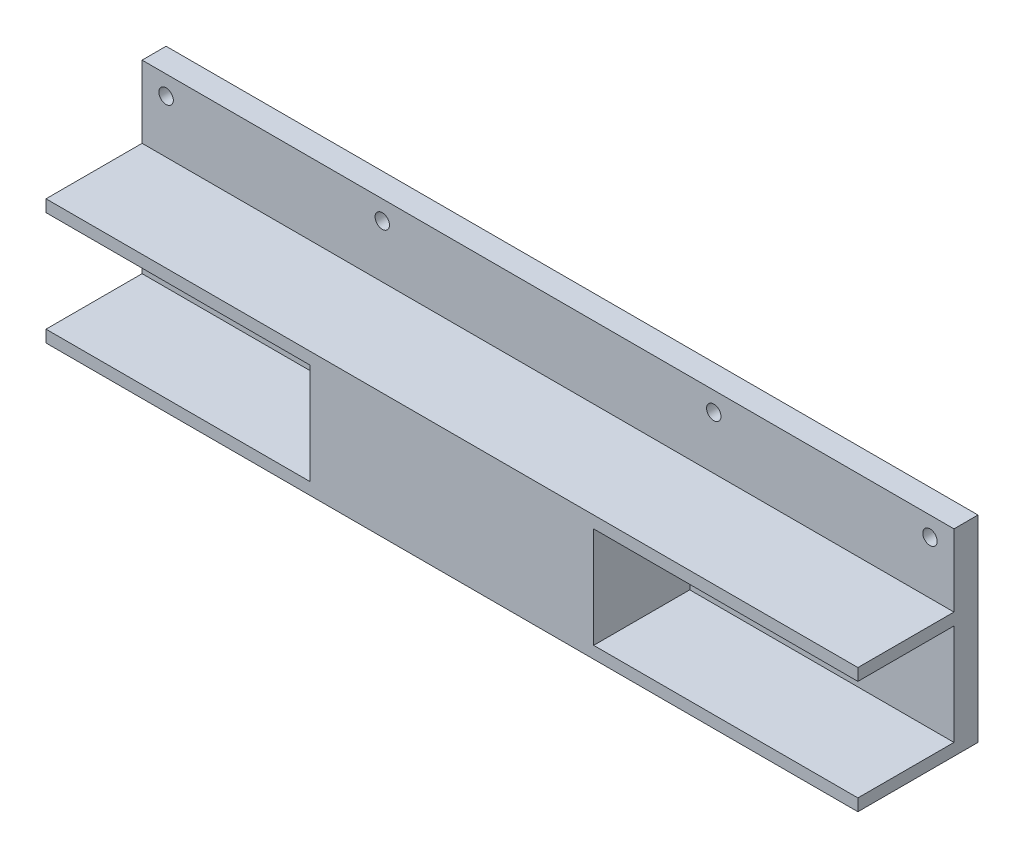
ISO-10303-21;
HEADER;
FILE_DESCRIPTION(('STEP AP214'),'2;1');
FILE_NAME('part.step','',(''),(''),'','','');
FILE_SCHEMA(('AUTOMOTIVE_DESIGN { 1 0 10303 214 1 1 1 1 }'));
ENDSEC;
DATA;
#1=APPLICATION_CONTEXT('core data for automotive mechanical design processes');
#2=APPLICATION_PROTOCOL_DEFINITION('international standard','automotive_design',2000,#1);
#3=PRODUCT_CONTEXT('',#1,'mechanical');
#4=PRODUCT('Part','Part','',(#3));
#5=PRODUCT_RELATED_PRODUCT_CATEGORY('part','',(#4));
#6=PRODUCT_DEFINITION_FORMATION('','',#4);
#7=PRODUCT_DEFINITION_CONTEXT('part definition',#1,'design');
#8=PRODUCT_DEFINITION('design','',#6,#7);
#9=PRODUCT_DEFINITION_SHAPE('','',#8);
#10=(LENGTH_UNIT() NAMED_UNIT(*) SI_UNIT(.MILLI.,.METRE.));
#11=(NAMED_UNIT(*) PLANE_ANGLE_UNIT() SI_UNIT($,.RADIAN.));
#12=(NAMED_UNIT(*) SI_UNIT($,.STERADIAN.) SOLID_ANGLE_UNIT());
#13=UNCERTAINTY_MEASURE_WITH_UNIT(LENGTH_MEASURE(1.E-05),#10,'distance_accuracy_value','');
#14=(GEOMETRIC_REPRESENTATION_CONTEXT(3) GLOBAL_UNCERTAINTY_ASSIGNED_CONTEXT((#13)) GLOBAL_UNIT_ASSIGNED_CONTEXT((#10,
#11,#12)) REPRESENTATION_CONTEXT('',''));
#15=CARTESIAN_POINT('',(0.,0.,0.));
#16=DIRECTION('',(0.,0.,1.));
#17=DIRECTION('',(1.,0.,0.));
#18=AXIS2_PLACEMENT_3D('',#15,#16,#17);
#19=CARTESIAN_POINT('',(0.,0.,5.));
#20=DIRECTION('',(0.,0.,-1.));
#21=DIRECTION('',(-1.,0.,0.));
#22=AXIS2_PLACEMENT_3D('',#19,#20,#21);
#23=PLANE('',#22);
#24=CARTESIAN_POINT('',(-79.5,16.5,5.));
#25=DIRECTION('',(0.,0.,1.));
#26=DIRECTION('',(1.,0.,0.));
#27=AXIS2_PLACEMENT_3D('',#24,#25,#26);
#28=CIRCLE('',#27,1.5);
#29=CARTESIAN_POINT('',(-78.,16.5,5.));
#30=VERTEX_POINT('',#29);
#31=EDGE_CURVE('E210',#30,#30,#28,.T.);
#32=ORIENTED_EDGE('',*,*,#31,.F.);
#33=EDGE_LOOP('',(#32));
#34=FACE_BOUND('',#33,.T.);
#35=CARTESIAN_POINT('',(-34.5,16.5,5.));
#36=DIRECTION('',(0.,0.,1.));
#37=DIRECTION('',(1.,0.,0.));
#38=AXIS2_PLACEMENT_3D('',#35,#36,#37);
#39=CIRCLE('',#38,1.5);
#40=CARTESIAN_POINT('',(-33.,16.5,5.));
#41=VERTEX_POINT('',#40);
#42=EDGE_CURVE('E227',#41,#41,#39,.T.);
#43=ORIENTED_EDGE('',*,*,#42,.F.);
#44=EDGE_LOOP('',(#43));
#45=FACE_BOUND('',#44,.T.);
#46=CARTESIAN_POINT('',(34.5,16.5,5.));
#47=DIRECTION('',(0.,0.,1.));
#48=DIRECTION('',(1.,0.,0.));
#49=AXIS2_PLACEMENT_3D('',#46,#47,#48);
#50=CIRCLE('',#49,1.5);
#51=CARTESIAN_POINT('',(36.,16.5,5.));
#52=VERTEX_POINT('',#51);
#53=EDGE_CURVE('E221',#52,#52,#50,.T.);
#54=ORIENTED_EDGE('',*,*,#53,.F.);
#55=EDGE_LOOP('',(#54));
#56=FACE_BOUND('',#55,.T.);
#57=CARTESIAN_POINT('',(79.5,16.5,5.));
#58=DIRECTION('',(0.,0.,1.));
#59=DIRECTION('',(1.,0.,0.));
#60=AXIS2_PLACEMENT_3D('',#57,#58,#59);
#61=CIRCLE('',#60,1.5);
#62=CARTESIAN_POINT('',(81.,16.5,5.));
#63=VERTEX_POINT('',#62);
#64=EDGE_CURVE('E215',#63,#63,#61,.T.);
#65=ORIENTED_EDGE('',*,*,#64,.F.);
#66=EDGE_LOOP('',(#65));
#67=FACE_BOUND('',#66,.T.);
#68=DIRECTION('',(-1.,0.,0.));
#69=VECTOR('',#68,1.);
#70=CARTESIAN_POINT('',(-84.5,5.49999999999996,5.));
#71=LINE('',#70,#69);
#72=CARTESIAN_POINT('',(84.5,5.49999999999997,5.));
#73=VERTEX_POINT('',#72);
#74=CARTESIAN_POINT('',(-84.5,5.49999999999996,5.));
#75=VERTEX_POINT('',#74);
#76=EDGE_CURVE('E186',#73,#75,#71,.T.);
#77=ORIENTED_EDGE('',*,*,#76,.F.);
#78=DIRECTION('',(0.,1.,0.));
#79=VECTOR('',#78,1.);
#80=CARTESIAN_POINT('',(84.5,-20.5,5.));
#81=LINE('',#80,#79);
#82=CARTESIAN_POINT('',(84.5,20.5,5.));
#83=VERTEX_POINT('',#82);
#84=EDGE_CURVE('E235',#73,#83,#81,.T.);
#85=ORIENTED_EDGE('',*,*,#84,.T.);
#86=DIRECTION('',(-1.,0.,0.));
#87=VECTOR('',#86,1.);
#88=CARTESIAN_POINT('',(-84.5,20.5,5.));
#89=LINE('',#88,#87);
#90=CARTESIAN_POINT('',(-84.5,20.5,5.));
#91=VERTEX_POINT('',#90);
#92=EDGE_CURVE('E237',#83,#91,#89,.T.);
#93=ORIENTED_EDGE('',*,*,#92,.T.);
#94=DIRECTION('',(0.,-1.,0.));
#95=VECTOR('',#94,1.);
#96=CARTESIAN_POINT('',(-84.5,-20.5,5.));
#97=LINE('',#96,#95);
#98=EDGE_CURVE('E240',#91,#75,#97,.T.);
#99=ORIENTED_EDGE('',*,*,#98,.T.);
#100=EDGE_LOOP('',(#77,#85,#93,#99));
#101=FACE_BOUND('',#100,.T.);
#102=ADVANCED_FACE('F33',(#34,#45,#56,#67,#101),#23,.F.);
#103=CARTESIAN_POINT('',(84.5,-20.5,5.));
#104=DIRECTION('',(-1.,0.,0.));
#105=DIRECTION('',(0.,0.,1.));
#106=AXIS2_PLACEMENT_3D('',#103,#104,#105);
#107=PLANE('',#106);
#108=DIRECTION('',(0.,1.,0.));
#109=VECTOR('',#108,1.);
#110=CARTESIAN_POINT('',(84.5,-20.5,25.));
#111=LINE('',#110,#109);
#112=CARTESIAN_POINT('',(84.5,2.99999999999998,25.));
#113=VERTEX_POINT('',#112);
#114=CARTESIAN_POINT('',(84.5,5.49999999999998,25.));
#115=VERTEX_POINT('',#114);
#116=EDGE_CURVE('E198',#113,#115,#111,.T.);
#117=ORIENTED_EDGE('',*,*,#116,.F.);
#118=DIRECTION('',(0.,0.,1.));
#119=VECTOR('',#118,1.);
#120=CARTESIAN_POINT('',(84.5,2.99999999999998,25.));
#121=LINE('',#120,#119);
#122=CARTESIAN_POINT('',(84.5,2.99999999999998,5.));
#123=VERTEX_POINT('',#122);
#124=EDGE_CURVE('E152',#123,#113,#121,.T.);
#125=ORIENTED_EDGE('',*,*,#124,.F.);
#126=DIRECTION('',(0.,1.,0.));
#127=VECTOR('',#126,1.);
#128=CARTESIAN_POINT('',(84.5,2.99999999999998,5.));
#129=LINE('',#128,#127);
#130=CARTESIAN_POINT('',(84.5,-18.,4.99999999999999));
#131=VERTEX_POINT('',#130);
#132=EDGE_CURVE('E278',#131,#123,#129,.T.);
#133=ORIENTED_EDGE('',*,*,#132,.F.);
#134=DIRECTION('',(0.,0.,-1.));
#135=VECTOR('',#134,1.);
#136=CARTESIAN_POINT('',(84.5,-18.,25.));
#137=LINE('',#136,#135);
#138=CARTESIAN_POINT('',(84.5,-18.,25.));
#139=VERTEX_POINT('',#138);
#140=EDGE_CURVE('E275',#139,#131,#137,.T.);
#141=ORIENTED_EDGE('',*,*,#140,.F.);
#142=CARTESIAN_POINT('',(84.5,-20.5,25.));
#143=VERTEX_POINT('',#142);
#144=EDGE_CURVE('E158',#143,#139,#111,.T.);
#145=ORIENTED_EDGE('',*,*,#144,.F.);
#146=DIRECTION('',(0.,0.,-1.));
#147=VECTOR('',#146,1.);
#148=CARTESIAN_POINT('',(84.5,-20.5,5.));
#149=LINE('',#148,#147);
#150=CARTESIAN_POINT('',(84.5,-20.5,0.));
#151=VERTEX_POINT('',#150);
#152=EDGE_CURVE('E242',#143,#151,#149,.T.);
#153=ORIENTED_EDGE('',*,*,#152,.T.);
#154=DIRECTION('',(0.,1.,0.));
#155=VECTOR('',#154,1.);
#156=CARTESIAN_POINT('',(84.5,-20.5,0.));
#157=LINE('',#156,#155);
#158=CARTESIAN_POINT('',(84.5,20.5,0.));
#159=VERTEX_POINT('',#158);
#160=EDGE_CURVE('E214',#151,#159,#157,.T.);
#161=ORIENTED_EDGE('',*,*,#160,.T.);
#162=DIRECTION('',(0.,0.,-1.));
#163=VECTOR('',#162,1.);
#164=CARTESIAN_POINT('',(84.5,20.5,5.));
#165=LINE('',#164,#163);
#166=EDGE_CURVE('E11',#83,#159,#165,.T.);
#167=ORIENTED_EDGE('',*,*,#166,.F.);
#168=ORIENTED_EDGE('',*,*,#84,.F.);
#169=DIRECTION('',(0.,0.,-1.));
#170=VECTOR('',#169,1.);
#171=CARTESIAN_POINT('',(84.5,5.49999999999998,25.));
#172=LINE('',#171,#170);
#173=EDGE_CURVE('E207',#115,#73,#172,.T.);
#174=ORIENTED_EDGE('',*,*,#173,.F.);
#175=EDGE_LOOP('',(#117,#125,#133,#141,#145,#153,#161,#167,#168,#174));
#176=FACE_BOUND('',#175,.T.);
#177=ADVANCED_FACE('F35',(#176),#107,.F.);
#178=CARTESIAN_POINT('',(-84.5,20.5,5.));
#179=DIRECTION('',(0.,-1.,0.));
#180=DIRECTION('',(1.,0.,0.));
#181=AXIS2_PLACEMENT_3D('',#178,#179,#180);
#182=PLANE('',#181);
#183=DIRECTION('',(-1.,0.,0.));
#184=VECTOR('',#183,1.);
#185=CARTESIAN_POINT('',(-84.5,20.5,0.));
#186=LINE('',#185,#184);
#187=CARTESIAN_POINT('',(-84.5,20.5,0.));
#188=VERTEX_POINT('',#187);
#189=EDGE_CURVE('E245',#159,#188,#186,.T.);
#190=ORIENTED_EDGE('',*,*,#189,.T.);
#191=DIRECTION('',(0.,0.,-1.));
#192=VECTOR('',#191,1.);
#193=CARTESIAN_POINT('',(-84.5,20.5,5.));
#194=LINE('',#193,#192);
#195=EDGE_CURVE('E41',#91,#188,#194,.T.);
#196=ORIENTED_EDGE('',*,*,#195,.F.);
#197=ORIENTED_EDGE('',*,*,#92,.F.);
#198=ORIENTED_EDGE('',*,*,#166,.T.);
#199=EDGE_LOOP('',(#190,#196,#197,#198));
#200=FACE_BOUND('',#199,.T.);
#201=ADVANCED_FACE('F322',(#200),#182,.F.);
#202=CARTESIAN_POINT('',(-84.5,-20.5,5.));
#203=DIRECTION('',(1.,0.,0.));
#204=DIRECTION('',(0.,0.,-1.));
#205=AXIS2_PLACEMENT_3D('',#202,#203,#204);
#206=PLANE('',#205);
#207=DIRECTION('',(0.,-1.,0.));
#208=VECTOR('',#207,1.);
#209=CARTESIAN_POINT('',(-84.5,-20.5,25.));
#210=LINE('',#209,#208);
#211=CARTESIAN_POINT('',(-84.5,-18.,25.));
#212=VERTEX_POINT('',#211);
#213=CARTESIAN_POINT('',(-84.5,-20.5,25.));
#214=VERTEX_POINT('',#213);
#215=EDGE_CURVE('E196',#212,#214,#210,.T.);
#216=ORIENTED_EDGE('',*,*,#215,.F.);
#217=DIRECTION('',(0.,0.,1.));
#218=VECTOR('',#217,1.);
#219=CARTESIAN_POINT('',(-84.5,-18.,25.));
#220=LINE('',#219,#218);
#221=CARTESIAN_POINT('',(-84.5,-18.,5.));
#222=VERTEX_POINT('',#221);
#223=EDGE_CURVE('E168',#222,#212,#220,.T.);
#224=ORIENTED_EDGE('',*,*,#223,.F.);
#225=DIRECTION('',(0.,-1.,0.));
#226=VECTOR('',#225,1.);
#227=CARTESIAN_POINT('',(-84.5,-18.,5.));
#228=LINE('',#227,#226);
#229=CARTESIAN_POINT('',(-84.5,2.99999999999995,5.));
#230=VERTEX_POINT('',#229);
#231=EDGE_CURVE('E178',#230,#222,#228,.T.);
#232=ORIENTED_EDGE('',*,*,#231,.F.);
#233=DIRECTION('',(0.,0.,-1.));
#234=VECTOR('',#233,1.);
#235=CARTESIAN_POINT('',(-84.5,2.99999999999996,25.));
#236=LINE('',#235,#234);
#237=CARTESIAN_POINT('',(-84.5,2.99999999999996,25.));
#238=VERTEX_POINT('',#237);
#239=EDGE_CURVE('E175',#238,#230,#236,.T.);
#240=ORIENTED_EDGE('',*,*,#239,.F.);
#241=CARTESIAN_POINT('',(-84.5,5.49999999999996,25.));
#242=VERTEX_POINT('',#241);
#243=EDGE_CURVE('E192',#242,#238,#210,.T.);
#244=ORIENTED_EDGE('',*,*,#243,.F.);
#245=DIRECTION('',(0.,0.,-1.));
#246=VECTOR('',#245,1.);
#247=CARTESIAN_POINT('',(-84.5,5.49999999999996,25.));
#248=LINE('',#247,#246);
#249=EDGE_CURVE('E202',#242,#75,#248,.T.);
#250=ORIENTED_EDGE('',*,*,#249,.T.);
#251=ORIENTED_EDGE('',*,*,#98,.F.);
#252=ORIENTED_EDGE('',*,*,#195,.T.);
#253=DIRECTION('',(0.,-1.,0.));
#254=VECTOR('',#253,1.);
#255=CARTESIAN_POINT('',(-84.5,-20.5,0.));
#256=LINE('',#255,#254);
#257=CARTESIAN_POINT('',(-84.5,-20.5,0.));
#258=VERTEX_POINT('',#257);
#259=EDGE_CURVE('E247',#188,#258,#256,.T.);
#260=ORIENTED_EDGE('',*,*,#259,.T.);
#261=DIRECTION('',(0.,0.,-1.));
#262=VECTOR('',#261,1.);
#263=CARTESIAN_POINT('',(-84.5,-20.5,5.));
#264=LINE('',#263,#262);
#265=EDGE_CURVE('E252',#214,#258,#264,.T.);
#266=ORIENTED_EDGE('',*,*,#265,.F.);
#267=EDGE_LOOP('',(#216,#224,#232,#240,#244,#250,#251,#252,#260,#266));
#268=FACE_BOUND('',#267,.T.);
#269=ADVANCED_FACE('F260',(#268),#206,.F.);
#270=CARTESIAN_POINT('',(-84.5,-20.5,5.));
#271=DIRECTION('',(0.,1.,0.));
#272=DIRECTION('',(-1.,0.,0.));
#273=AXIS2_PLACEMENT_3D('',#270,#271,#272);
#274=PLANE('',#273);
#275=DIRECTION('',(1.,0.,0.));
#276=VECTOR('',#275,1.);
#277=CARTESIAN_POINT('',(-84.5,-20.5,0.));
#278=LINE('',#277,#276);
#279=EDGE_CURVE('E238',#258,#151,#278,.T.);
#280=ORIENTED_EDGE('',*,*,#279,.T.);
#281=ORIENTED_EDGE('',*,*,#152,.F.);
#282=DIRECTION('',(1.,0.,0.));
#283=VECTOR('',#282,1.);
#284=CARTESIAN_POINT('',(-84.5,-20.5,25.));
#285=LINE('',#284,#283);
#286=EDGE_CURVE('E195',#214,#143,#285,.T.);
#287=ORIENTED_EDGE('',*,*,#286,.F.);
#288=ORIENTED_EDGE('',*,*,#265,.T.);
#289=EDGE_LOOP('',(#280,#281,#287,#288));
#290=FACE_BOUND('',#289,.T.);
#291=ADVANCED_FACE('F269',(#290),#274,.F.);
#292=CARTESIAN_POINT('',(0.,0.,0.));
#293=DIRECTION('',(0.,0.,-1.));
#294=DIRECTION('',(-1.,0.,0.));
#295=AXIS2_PLACEMENT_3D('',#292,#293,#294);
#296=PLANE('',#295);
#297=CARTESIAN_POINT('',(79.5,16.5,0.));
#298=DIRECTION('',(0.,0.,1.));
#299=DIRECTION('',(1.,0.,0.));
#300=AXIS2_PLACEMENT_3D('',#297,#298,#299);
#301=CIRCLE('',#300,1.5);
#302=CARTESIAN_POINT('',(81.,16.5,0.));
#303=VERTEX_POINT('',#302);
#304=EDGE_CURVE('E211',#303,#303,#301,.T.);
#305=ORIENTED_EDGE('',*,*,#304,.T.);
#306=EDGE_LOOP('',(#305));
#307=FACE_BOUND('',#306,.T.);
#308=CARTESIAN_POINT('',(34.5,16.5,0.));
#309=DIRECTION('',(0.,0.,1.));
#310=DIRECTION('',(1.,0.,0.));
#311=AXIS2_PLACEMENT_3D('',#308,#309,#310);
#312=CIRCLE('',#311,1.5);
#313=CARTESIAN_POINT('',(36.,16.5,0.));
#314=VERTEX_POINT('',#313);
#315=EDGE_CURVE('E218',#314,#314,#312,.T.);
#316=ORIENTED_EDGE('',*,*,#315,.T.);
#317=EDGE_LOOP('',(#316));
#318=FACE_BOUND('',#317,.T.);
#319=CARTESIAN_POINT('',(-34.5,16.5,0.));
#320=DIRECTION('',(0.,0.,1.));
#321=DIRECTION('',(1.,0.,0.));
#322=AXIS2_PLACEMENT_3D('',#319,#320,#321);
#323=CIRCLE('',#322,1.5);
#324=CARTESIAN_POINT('',(-33.,16.5,0.));
#325=VERTEX_POINT('',#324);
#326=EDGE_CURVE('E224',#325,#325,#323,.T.);
#327=ORIENTED_EDGE('',*,*,#326,.T.);
#328=EDGE_LOOP('',(#327));
#329=FACE_BOUND('',#328,.T.);
#330=CARTESIAN_POINT('',(-79.5,16.5,0.));
#331=DIRECTION('',(0.,0.,1.));
#332=DIRECTION('',(1.,0.,0.));
#333=AXIS2_PLACEMENT_3D('',#330,#331,#332);
#334=CIRCLE('',#333,1.5);
#335=CARTESIAN_POINT('',(-78.,16.5,0.));
#336=VERTEX_POINT('',#335);
#337=EDGE_CURVE('E230',#336,#336,#334,.T.);
#338=ORIENTED_EDGE('',*,*,#337,.T.);
#339=EDGE_LOOP('',(#338));
#340=FACE_BOUND('',#339,.T.);
#341=ORIENTED_EDGE('',*,*,#160,.F.);
#342=ORIENTED_EDGE('',*,*,#279,.F.);
#343=ORIENTED_EDGE('',*,*,#259,.F.);
#344=ORIENTED_EDGE('',*,*,#189,.F.);
#345=EDGE_LOOP('',(#341,#342,#343,#344));
#346=FACE_BOUND('',#345,.T.);
#347=ADVANCED_FACE('F267',(#307,#318,#329,#340,#346),#296,.T.);
#348=CARTESIAN_POINT('',(-79.5,16.5,0.));
#349=DIRECTION('',(0.,0.,1.));
#350=DIRECTION('',(1.,0.,0.));
#351=AXIS2_PLACEMENT_3D('',#348,#349,#350);
#352=CYLINDRICAL_SURFACE('',#351,1.5);
#353=ORIENTED_EDGE('',*,*,#337,.F.);
#354=EDGE_LOOP('',(#353));
#355=FACE_BOUND('',#354,.T.);
#356=ORIENTED_EDGE('',*,*,#31,.T.);
#357=EDGE_LOOP('',(#356));
#358=FACE_BOUND('',#357,.T.);
#359=ADVANCED_FACE('F327',(#355,#358),#352,.F.);
#360=CARTESIAN_POINT('',(-34.5,16.5,0.));
#361=DIRECTION('',(0.,0.,1.));
#362=DIRECTION('',(1.,0.,0.));
#363=AXIS2_PLACEMENT_3D('',#360,#361,#362);
#364=CYLINDRICAL_SURFACE('',#363,1.5);
#365=ORIENTED_EDGE('',*,*,#326,.F.);
#366=EDGE_LOOP('',(#365));
#367=FACE_BOUND('',#366,.T.);
#368=ORIENTED_EDGE('',*,*,#42,.T.);
#369=EDGE_LOOP('',(#368));
#370=FACE_BOUND('',#369,.T.);
#371=ADVANCED_FACE('F361',(#367,#370),#364,.F.);
#372=CARTESIAN_POINT('',(34.5,16.5,0.));
#373=DIRECTION('',(0.,0.,1.));
#374=DIRECTION('',(1.,0.,0.));
#375=AXIS2_PLACEMENT_3D('',#372,#373,#374);
#376=CYLINDRICAL_SURFACE('',#375,1.5);
#377=ORIENTED_EDGE('',*,*,#315,.F.);
#378=EDGE_LOOP('',(#377));
#379=FACE_BOUND('',#378,.T.);
#380=ORIENTED_EDGE('',*,*,#53,.T.);
#381=EDGE_LOOP('',(#380));
#382=FACE_BOUND('',#381,.T.);
#383=ADVANCED_FACE('F368',(#379,#382),#376,.F.);
#384=CARTESIAN_POINT('',(79.5,16.5,0.));
#385=DIRECTION('',(0.,0.,1.));
#386=DIRECTION('',(1.,0.,0.));
#387=AXIS2_PLACEMENT_3D('',#384,#385,#386);
#388=CYLINDRICAL_SURFACE('',#387,1.5);
#389=ORIENTED_EDGE('',*,*,#304,.F.);
#390=EDGE_LOOP('',(#389));
#391=FACE_BOUND('',#390,.T.);
#392=ORIENTED_EDGE('',*,*,#64,.T.);
#393=EDGE_LOOP('',(#392));
#394=FACE_BOUND('',#393,.T.);
#395=ADVANCED_FACE('F375',(#391,#394),#388,.F.);
#396=CARTESIAN_POINT('',(-84.5,5.49999999999996,25.));
#397=DIRECTION('',(0.,-1.,0.));
#398=DIRECTION('',(1.,0.,0.));
#399=AXIS2_PLACEMENT_3D('',#396,#397,#398);
#400=PLANE('',#399);
#401=ORIENTED_EDGE('',*,*,#76,.T.);
#402=ORIENTED_EDGE('',*,*,#249,.F.);
#403=DIRECTION('',(-1.,0.,0.));
#404=VECTOR('',#403,1.);
#405=CARTESIAN_POINT('',(-84.5,5.49999999999996,25.));
#406=LINE('',#405,#404);
#407=EDGE_CURVE('E200',#115,#242,#406,.T.);
#408=ORIENTED_EDGE('',*,*,#407,.F.);
#409=ORIENTED_EDGE('',*,*,#173,.T.);
#410=EDGE_LOOP('',(#401,#402,#408,#409));
#411=FACE_BOUND('',#410,.T.);
#412=ADVANCED_FACE('F295',(#411),#400,.F.);
#413=CARTESIAN_POINT('',(0.,0.,25.));
#414=DIRECTION('',(0.,0.,-1.));
#415=DIRECTION('',(-1.,0.,0.));
#416=AXIS2_PLACEMENT_3D('',#413,#414,#415);
#417=PLANE('',#416);
#418=DIRECTION('',(0.,-1.,0.));
#419=VECTOR('',#418,1.);
#420=CARTESIAN_POINT('',(29.5,2.99999999999998,25.));
#421=LINE('',#420,#419);
#422=CARTESIAN_POINT('',(29.5,2.99999999999998,25.));
#423=VERTEX_POINT('',#422);
#424=CARTESIAN_POINT('',(29.5,-18.,25.));
#425=VERTEX_POINT('',#424);
#426=EDGE_CURVE('E146',#423,#425,#421,.T.);
#427=ORIENTED_EDGE('',*,*,#426,.F.);
#428=DIRECTION('',(1.,0.,0.));
#429=VECTOR('',#428,1.);
#430=CARTESIAN_POINT('',(29.5,2.99999999999998,25.));
#431=LINE('',#430,#429);
#432=EDGE_CURVE('E179',#423,#113,#431,.T.);
#433=ORIENTED_EDGE('',*,*,#432,.T.);
#434=ORIENTED_EDGE('',*,*,#116,.T.);
#435=ORIENTED_EDGE('',*,*,#407,.T.);
#436=ORIENTED_EDGE('',*,*,#243,.T.);
#437=DIRECTION('',(-1.,0.,0.));
#438=VECTOR('',#437,1.);
#439=CARTESIAN_POINT('',(-29.5,2.99999999999996,25.));
#440=LINE('',#439,#438);
#441=CARTESIAN_POINT('',(-29.5,2.99999999999996,25.));
#442=VERTEX_POINT('',#441);
#443=EDGE_CURVE('E174',#442,#238,#440,.T.);
#444=ORIENTED_EDGE('',*,*,#443,.F.);
#445=DIRECTION('',(0.,1.,0.));
#446=VECTOR('',#445,1.);
#447=CARTESIAN_POINT('',(-29.5,-18.,25.));
#448=LINE('',#447,#446);
#449=CARTESIAN_POINT('',(-29.5,-18.,25.));
#450=VERTEX_POINT('',#449);
#451=EDGE_CURVE('E165',#450,#442,#448,.T.);
#452=ORIENTED_EDGE('',*,*,#451,.F.);
#453=DIRECTION('',(-1.,0.,0.));
#454=VECTOR('',#453,1.);
#455=CARTESIAN_POINT('',(-29.5,-18.,25.));
#456=LINE('',#455,#454);
#457=EDGE_CURVE('E183',#450,#212,#456,.T.);
#458=ORIENTED_EDGE('',*,*,#457,.T.);
#459=ORIENTED_EDGE('',*,*,#215,.T.);
#460=ORIENTED_EDGE('',*,*,#286,.T.);
#461=ORIENTED_EDGE('',*,*,#144,.T.);
#462=DIRECTION('',(1.,0.,0.));
#463=VECTOR('',#462,1.);
#464=CARTESIAN_POINT('',(29.5,-18.,25.));
#465=LINE('',#464,#463);
#466=EDGE_CURVE('E141',#425,#139,#465,.T.);
#467=ORIENTED_EDGE('',*,*,#466,.F.);
#468=EDGE_LOOP('',(#427,#433,#434,#435,#436,#444,#452,#458,#459,#460,#461,#467));
#469=FACE_BOUND('',#468,.T.);
#470=ADVANCED_FACE('F155',(#469),#417,.F.);
#471=CARTESIAN_POINT('',(-29.5,-18.,25.));
#472=DIRECTION('',(0.,-1.,0.));
#473=DIRECTION('',(0.,0.,-1.));
#474=AXIS2_PLACEMENT_3D('',#471,#472,#473);
#475=PLANE('',#474);
#476=ORIENTED_EDGE('',*,*,#223,.T.);
#477=ORIENTED_EDGE('',*,*,#457,.F.);
#478=DIRECTION('',(0.,0.,1.));
#479=VECTOR('',#478,1.);
#480=CARTESIAN_POINT('',(-29.5,-18.,25.));
#481=LINE('',#480,#479);
#482=CARTESIAN_POINT('',(-29.5,-18.,5.));
#483=VERTEX_POINT('',#482);
#484=EDGE_CURVE('E56',#483,#450,#481,.T.);
#485=ORIENTED_EDGE('',*,*,#484,.F.);
#486=DIRECTION('',(-1.,0.,0.));
#487=VECTOR('',#486,1.);
#488=CARTESIAN_POINT('',(-29.5,-18.,5.));
#489=LINE('',#488,#487);
#490=EDGE_CURVE('E187',#483,#222,#489,.T.);
#491=ORIENTED_EDGE('',*,*,#490,.T.);
#492=EDGE_LOOP('',(#476,#477,#485,#491));
#493=FACE_BOUND('',#492,.T.);
#494=ADVANCED_FACE('F306',(#493),#475,.F.);
#495=CARTESIAN_POINT('',(-29.5,-18.,5.));
#496=DIRECTION('',(0.,0.,-1.));
#497=DIRECTION('',(0.,1.,0.));
#498=AXIS2_PLACEMENT_3D('',#495,#496,#497);
#499=PLANE('',#498);
#500=ORIENTED_EDGE('',*,*,#231,.T.);
#501=ORIENTED_EDGE('',*,*,#490,.F.);
#502=DIRECTION('',(0.,-1.,0.));
#503=VECTOR('',#502,1.);
#504=CARTESIAN_POINT('',(-29.5,-18.,5.));
#505=LINE('',#504,#503);
#506=CARTESIAN_POINT('',(-29.5,2.99999999999995,5.));
#507=VERTEX_POINT('',#506);
#508=EDGE_CURVE('E171',#507,#483,#505,.T.);
#509=ORIENTED_EDGE('',*,*,#508,.F.);
#510=DIRECTION('',(-1.,0.,0.));
#511=VECTOR('',#510,1.);
#512=CARTESIAN_POINT('',(-29.5,2.99999999999995,5.));
#513=LINE('',#512,#511);
#514=EDGE_CURVE('E189',#507,#230,#513,.T.);
#515=ORIENTED_EDGE('',*,*,#514,.T.);
#516=EDGE_LOOP('',(#500,#501,#509,#515));
#517=FACE_BOUND('',#516,.T.);
#518=ADVANCED_FACE('F307',(#517),#499,.F.);
#519=CARTESIAN_POINT('',(-29.5,2.99999999999996,25.));
#520=DIRECTION('',(0.,1.,0.));
#521=DIRECTION('',(0.,0.,1.));
#522=AXIS2_PLACEMENT_3D('',#519,#520,#521);
#523=PLANE('',#522);
#524=ORIENTED_EDGE('',*,*,#239,.T.);
#525=ORIENTED_EDGE('',*,*,#514,.F.);
#526=DIRECTION('',(0.,0.,-1.));
#527=VECTOR('',#526,1.);
#528=CARTESIAN_POINT('',(-29.5,2.99999999999996,25.));
#529=LINE('',#528,#527);
#530=EDGE_CURVE('E167',#442,#507,#529,.T.);
#531=ORIENTED_EDGE('',*,*,#530,.F.);
#532=ORIENTED_EDGE('',*,*,#443,.T.);
#533=EDGE_LOOP('',(#524,#525,#531,#532));
#534=FACE_BOUND('',#533,.T.);
#535=ADVANCED_FACE('F300',(#534),#523,.F.);
#536=CARTESIAN_POINT('',(-29.5,0.,0.));
#537=DIRECTION('',(-1.,0.,0.));
#538=DIRECTION('',(0.,0.,1.));
#539=AXIS2_PLACEMENT_3D('',#536,#537,#538);
#540=PLANE('',#539);
#541=ORIENTED_EDGE('',*,*,#451,.T.);
#542=ORIENTED_EDGE('',*,*,#530,.T.);
#543=ORIENTED_EDGE('',*,*,#508,.T.);
#544=ORIENTED_EDGE('',*,*,#484,.T.);
#545=EDGE_LOOP('',(#541,#542,#543,#544));
#546=FACE_BOUND('',#545,.T.);
#547=ADVANCED_FACE('F303',(#546),#540,.T.);
#548=CARTESIAN_POINT('',(29.5,2.99999999999998,25.));
#549=DIRECTION('',(0.,1.,0.));
#550=DIRECTION('',(0.,0.,1.));
#551=AXIS2_PLACEMENT_3D('',#548,#549,#550);
#552=PLANE('',#551);
#553=ORIENTED_EDGE('',*,*,#124,.T.);
#554=ORIENTED_EDGE('',*,*,#432,.F.);
#555=DIRECTION('',(0.,0.,1.));
#556=VECTOR('',#555,1.);
#557=CARTESIAN_POINT('',(29.5,2.99999999999998,25.));
#558=LINE('',#557,#556);
#559=CARTESIAN_POINT('',(29.5,2.99999999999998,5.));
#560=VERTEX_POINT('',#559);
#561=EDGE_CURVE('E48',#560,#423,#558,.T.);
#562=ORIENTED_EDGE('',*,*,#561,.F.);
#563=DIRECTION('',(1.,0.,0.));
#564=VECTOR('',#563,1.);
#565=CARTESIAN_POINT('',(29.5,2.99999999999998,5.));
#566=LINE('',#565,#564);
#567=EDGE_CURVE('E160',#560,#123,#566,.T.);
#568=ORIENTED_EDGE('',*,*,#567,.T.);
#569=EDGE_LOOP('',(#553,#554,#562,#568));
#570=FACE_BOUND('',#569,.T.);
#571=ADVANCED_FACE('F285',(#570),#552,.F.);
#572=CARTESIAN_POINT('',(29.5,2.99999999999998,5.));
#573=DIRECTION('',(0.,0.,-1.));
#574=DIRECTION('',(0.,1.,0.));
#575=AXIS2_PLACEMENT_3D('',#572,#573,#574);
#576=PLANE('',#575);
#577=ORIENTED_EDGE('',*,*,#132,.T.);
#578=ORIENTED_EDGE('',*,*,#567,.F.);
#579=DIRECTION('',(0.,1.,0.));
#580=VECTOR('',#579,1.);
#581=CARTESIAN_POINT('',(29.5,2.99999999999998,5.));
#582=LINE('',#581,#580);
#583=CARTESIAN_POINT('',(29.5,-18.,4.99999999999999));
#584=VERTEX_POINT('',#583);
#585=EDGE_CURVE('E145',#584,#560,#582,.T.);
#586=ORIENTED_EDGE('',*,*,#585,.F.);
#587=DIRECTION('',(1.,0.,0.));
#588=VECTOR('',#587,1.);
#589=CARTESIAN_POINT('',(29.5,-18.,4.99999999999999));
#590=LINE('',#589,#588);
#591=EDGE_CURVE('E143',#584,#131,#590,.T.);
#592=ORIENTED_EDGE('',*,*,#591,.T.);
#593=EDGE_LOOP('',(#577,#578,#586,#592));
#594=FACE_BOUND('',#593,.T.);
#595=ADVANCED_FACE('F287',(#594),#576,.F.);
#596=CARTESIAN_POINT('',(29.5,-18.,25.));
#597=DIRECTION('',(0.,-1.,0.));
#598=DIRECTION('',(0.,0.,-1.));
#599=AXIS2_PLACEMENT_3D('',#596,#597,#598);
#600=PLANE('',#599);
#601=ORIENTED_EDGE('',*,*,#140,.T.);
#602=ORIENTED_EDGE('',*,*,#591,.F.);
#603=DIRECTION('',(0.,0.,-1.));
#604=VECTOR('',#603,1.);
#605=CARTESIAN_POINT('',(29.5,-18.,25.));
#606=LINE('',#605,#604);
#607=EDGE_CURVE('E137',#425,#584,#606,.T.);
#608=ORIENTED_EDGE('',*,*,#607,.F.);
#609=ORIENTED_EDGE('',*,*,#466,.T.);
#610=EDGE_LOOP('',(#601,#602,#608,#609));
#611=FACE_BOUND('',#610,.T.);
#612=ADVANCED_FACE('F139',(#611),#600,.F.);
#613=CARTESIAN_POINT('',(29.5,0.,0.));
#614=DIRECTION('',(1.,0.,0.));
#615=DIRECTION('',(0.,0.,-1.));
#616=AXIS2_PLACEMENT_3D('',#613,#614,#615);
#617=PLANE('',#616);
#618=ORIENTED_EDGE('',*,*,#426,.T.);
#619=ORIENTED_EDGE('',*,*,#607,.T.);
#620=ORIENTED_EDGE('',*,*,#585,.T.);
#621=ORIENTED_EDGE('',*,*,#561,.T.);
#622=EDGE_LOOP('',(#618,#619,#620,#621));
#623=FACE_BOUND('',#622,.T.);
#624=ADVANCED_FACE('F149',(#623),#617,.T.);
#625=CLOSED_SHELL('',(#102,#177,#201,#269,#291,#347,#359,#371,#383,#395,#412,#470,#494,#518,
#535,#547,#571,#595,#612,#624));
#626=MANIFOLD_SOLID_BREP('B2',#625);
#627=ADVANCED_BREP_SHAPE_REPRESENTATION('',(#18,#626),#14);
#628=SHAPE_DEFINITION_REPRESENTATION(#9,#627);
ENDSEC;
END-ISO-10303-21;
